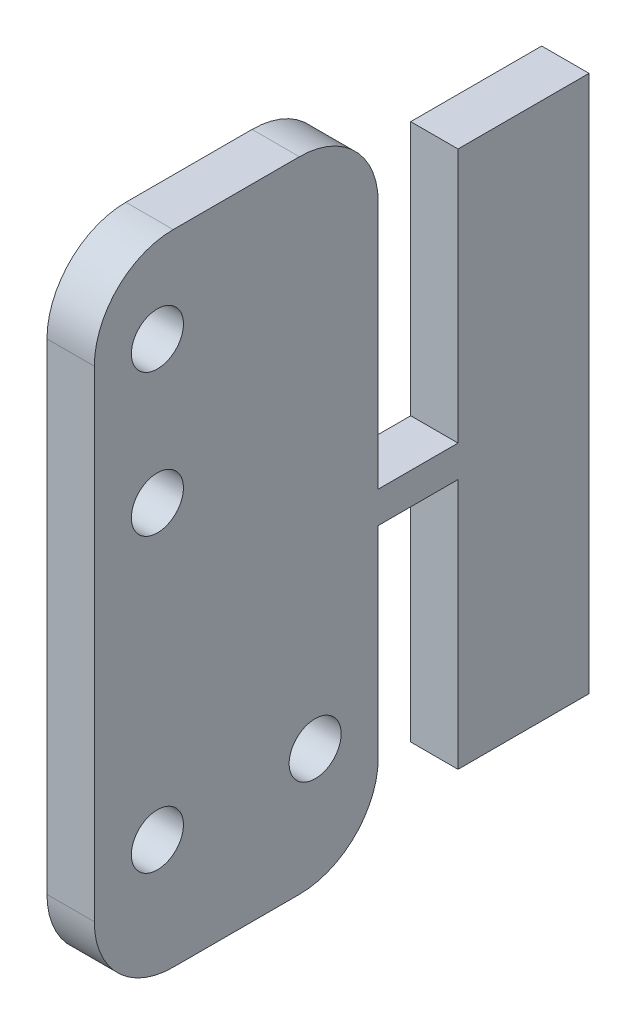
ISO-10303-21;
HEADER;
FILE_DESCRIPTION(('STEP AP214'),'2;1');
FILE_NAME('part.step','',(''),(''),'','','');
FILE_SCHEMA(('AUTOMOTIVE_DESIGN { 1 0 10303 214 1 1 1 1 }'));
ENDSEC;
DATA;
#1=APPLICATION_CONTEXT('core data for automotive mechanical design processes');
#2=APPLICATION_PROTOCOL_DEFINITION('international standard','automotive_design',2000,#1);
#3=PRODUCT_CONTEXT('',#1,'mechanical');
#4=PRODUCT('Part','Part','',(#3));
#5=PRODUCT_RELATED_PRODUCT_CATEGORY('part','',(#4));
#6=PRODUCT_DEFINITION_FORMATION('','',#4);
#7=PRODUCT_DEFINITION_CONTEXT('part definition',#1,'design');
#8=PRODUCT_DEFINITION('design','',#6,#7);
#9=PRODUCT_DEFINITION_SHAPE('','',#8);
#10=(LENGTH_UNIT() NAMED_UNIT(*) SI_UNIT(.MILLI.,.METRE.));
#11=(NAMED_UNIT(*) PLANE_ANGLE_UNIT() SI_UNIT($,.RADIAN.));
#12=(NAMED_UNIT(*) SI_UNIT($,.STERADIAN.) SOLID_ANGLE_UNIT());
#13=UNCERTAINTY_MEASURE_WITH_UNIT(LENGTH_MEASURE(1.E-05),#10,'distance_accuracy_value','');
#14=(GEOMETRIC_REPRESENTATION_CONTEXT(3) GLOBAL_UNCERTAINTY_ASSIGNED_CONTEXT((#13)) GLOBAL_UNIT_ASSIGNED_CONTEXT((#10,
#11,#12)) REPRESENTATION_CONTEXT('',''));
#15=CARTESIAN_POINT('',(0.,0.,0.));
#16=DIRECTION('',(0.,0.,1.));
#17=DIRECTION('',(1.,0.,0.));
#18=AXIS2_PLACEMENT_3D('',#15,#16,#17);
#19=CARTESIAN_POINT('',(5.,1.50221285621786,0.));
#20=DIRECTION('',(0.,0.,-1.));
#21=DIRECTION('',(0.,1.,0.));
#22=AXIS2_PLACEMENT_3D('',#19,#20,#21);
#23=PLANE('',#22);
#24=DIRECTION('',(1.,0.,0.));
#25=VECTOR('',#24,1.);
#26=CARTESIAN_POINT('',(0.,2.25110642810893,0.));
#27=LINE('',#26,#25);
#28=CARTESIAN_POINT('',(0.,2.25110642810893,0.));
#29=VERTEX_POINT('',#28);
#30=CARTESIAN_POINT('',(3.,2.25110642810893,0.));
#31=VERTEX_POINT('',#30);
#32=EDGE_CURVE('E218',#29,#31,#27,.T.);
#33=ORIENTED_EDGE('',*,*,#32,.T.);
#34=DIRECTION('',(0.,-1.,0.));
#35=VECTOR('',#34,1.);
#36=CARTESIAN_POINT('',(3.,-15.4977871437821,0.));
#37=LINE('',#36,#35);
#38=CARTESIAN_POINT('',(3.,-10.4977871437821,0.));
#39=VERTEX_POINT('',#38);
#40=EDGE_CURVE('E273',#39,#31,#37,.F.);
#41=ORIENTED_EDGE('',*,*,#40,.F.);
#42=DIRECTION('',(-1.,0.,0.));
#43=VECTOR('',#42,1.);
#44=CARTESIAN_POINT('',(5.,-10.4977871437821,0.));
#45=LINE('',#44,#43);
#46=CARTESIAN_POINT('',(0.,-10.4977871437821,0.));
#47=VERTEX_POINT('',#46);
#48=EDGE_CURVE('E12',#39,#47,#45,.T.);
#49=ORIENTED_EDGE('',*,*,#48,.T.);
#50=DIRECTION('',(0.,1.,0.));
#51=VECTOR('',#50,1.);
#52=CARTESIAN_POINT('',(0.,-15.4977871437821,0.));
#53=LINE('',#52,#51);
#54=EDGE_CURVE('E276',#47,#29,#53,.T.);
#55=ORIENTED_EDGE('',*,*,#54,.T.);
#56=EDGE_LOOP('',(#33,#41,#49,#55));
#57=FACE_BOUND('',#56,.T.);
#58=ADVANCED_FACE('F41',(#57),#23,.T.);
#59=DIRECTION('',(1.,0.,0.));
#60=VECTOR('',#59,1.);
#61=CARTESIAN_POINT('',(0.,4.25110642810894,0.));
#62=LINE('',#61,#60);
#63=CARTESIAN_POINT('',(0.,4.25110642810894,0.));
#64=VERTEX_POINT('',#63);
#65=CARTESIAN_POINT('',(3.,4.25110642810894,0.));
#66=VERTEX_POINT('',#65);
#67=EDGE_CURVE('E221',#64,#66,#62,.T.);
#68=ORIENTED_EDGE('',*,*,#67,.F.);
#69=CARTESIAN_POINT('',(0.,20.,0.));
#70=VERTEX_POINT('',#69);
#71=EDGE_CURVE('E280',#64,#70,#53,.T.);
#72=ORIENTED_EDGE('',*,*,#71,.T.);
#73=DIRECTION('',(1.,0.,0.));
#74=VECTOR('',#73,1.);
#75=CARTESIAN_POINT('',(3.,20.,0.));
#76=LINE('',#75,#74);
#77=CARTESIAN_POINT('',(3.,20.,0.));
#78=VERTEX_POINT('',#77);
#79=EDGE_CURVE('E224',#70,#78,#76,.T.);
#80=ORIENTED_EDGE('',*,*,#79,.T.);
#81=EDGE_CURVE('E279',#66,#78,#37,.F.);
#82=ORIENTED_EDGE('',*,*,#81,.F.);
#83=EDGE_LOOP('',(#68,#72,#80,#82));
#84=FACE_BOUND('',#83,.T.);
#85=ADVANCED_FACE('F333',(#84),#23,.T.);
#86=CARTESIAN_POINT('',(0.,0.,18.));
#87=DIRECTION('',(-1.,0.,0.));
#88=DIRECTION('',(0.,0.,1.));
#89=AXIS2_PLACEMENT_3D('',#86,#87,#88);
#90=PLANE('',#89);
#91=CARTESIAN_POINT('',(0.,-7.99778714378214,14.));
#92=DIRECTION('',(1.,0.,0.));
#93=DIRECTION('',(0.,0.,-1.));
#94=AXIS2_PLACEMENT_3D('',#91,#92,#93);
#95=CIRCLE('',#94,1.65);
#96=CARTESIAN_POINT('',(0.,-7.99778714378214,12.35));
#97=VERTEX_POINT('',#96);
#98=EDGE_CURVE('E227',#97,#97,#95,.T.);
#99=ORIENTED_EDGE('',*,*,#98,.T.);
#100=EDGE_LOOP('',(#99));
#101=FACE_BOUND('',#100,.T.);
#102=CARTESIAN_POINT('',(0.,-7.99778714378214,4.));
#103=DIRECTION('',(1.,0.,0.));
#104=DIRECTION('',(0.,0.,1.));
#105=AXIS2_PLACEMENT_3D('',#102,#103,#104);
#106=CIRCLE('',#105,1.65);
#107=CARTESIAN_POINT('',(0.,-7.99778714378214,5.65));
#108=VERTEX_POINT('',#107);
#109=EDGE_CURVE('E266',#108,#108,#106,.T.);
#110=ORIENTED_EDGE('',*,*,#109,.T.);
#111=EDGE_LOOP('',(#110));
#112=FACE_BOUND('',#111,.T.);
#113=DIRECTION('',(0.,0.,-1.));
#114=VECTOR('',#113,1.);
#115=CARTESIAN_POINT('',(0.,-15.4977871437821,18.));
#116=LINE('',#115,#114);
#117=CARTESIAN_POINT('',(0.,-15.4977871437821,13.));
#118=VERTEX_POINT('',#117);
#119=CARTESIAN_POINT('',(0.,-15.4977871437821,5.));
#120=VERTEX_POINT('',#119);
#121=EDGE_CURVE('E283',#118,#120,#116,.T.);
#122=ORIENTED_EDGE('',*,*,#121,.F.);
#123=CARTESIAN_POINT('',(0.,-10.4977871437821,13.));
#124=DIRECTION('',(-1.,0.,0.));
#125=DIRECTION('',(0.,0.,-1.));
#126=AXIS2_PLACEMENT_3D('',#123,#124,#125);
#127=CIRCLE('',#126,5.);
#128=CARTESIAN_POINT('',(0.,-10.4977871437821,18.));
#129=VERTEX_POINT('',#128);
#130=EDGE_CURVE('E297',#118,#129,#127,.T.);
#131=ORIENTED_EDGE('',*,*,#130,.T.);
#132=DIRECTION('',(0.,1.,0.));
#133=VECTOR('',#132,1.);
#134=CARTESIAN_POINT('',(0.,-15.4977871437821,18.));
#135=LINE('',#134,#133);
#136=CARTESIAN_POINT('',(0.,20.,18.));
#137=VERTEX_POINT('',#136);
#138=EDGE_CURVE('E270',#129,#137,#135,.T.);
#139=ORIENTED_EDGE('',*,*,#138,.T.);
#140=CARTESIAN_POINT('',(0.,20.,13.));
#141=DIRECTION('',(-1.,0.,0.));
#142=DIRECTION('',(0.,0.,1.));
#143=AXIS2_PLACEMENT_3D('',#140,#141,#142);
#144=CIRCLE('',#143,5.);
#145=CARTESIAN_POINT('',(0.,25.,13.));
#146=VERTEX_POINT('',#145);
#147=EDGE_CURVE('E242',#137,#146,#144,.T.);
#148=ORIENTED_EDGE('',*,*,#147,.T.);
#149=DIRECTION('',(0.,0.,-1.));
#150=VECTOR('',#149,1.);
#151=CARTESIAN_POINT('',(0.,25.,18.));
#152=LINE('',#151,#150);
#153=CARTESIAN_POINT('',(0.,25.,5.));
#154=VERTEX_POINT('',#153);
#155=EDGE_CURVE('E247',#146,#154,#152,.T.);
#156=ORIENTED_EDGE('',*,*,#155,.T.);
#157=CARTESIAN_POINT('',(0.,20.,5.));
#158=DIRECTION('',(-1.,0.,0.));
#159=DIRECTION('',(0.,0.,1.));
#160=AXIS2_PLACEMENT_3D('',#157,#158,#159);
#161=CIRCLE('',#160,5.);
#162=EDGE_CURVE('E244',#154,#70,#161,.T.);
#163=ORIENTED_EDGE('',*,*,#162,.T.);
#164=ORIENTED_EDGE('',*,*,#71,.F.);
#165=DIRECTION('',(0.,0.,1.));
#166=VECTOR('',#165,1.);
#167=CARTESIAN_POINT('',(0.,4.25110642810894,-5.05782413934766));
#168=LINE('',#167,#166);
#169=CARTESIAN_POINT('',(0.,4.25110642810894,-5.05782413934766));
#170=VERTEX_POINT('',#169);
#171=EDGE_CURVE('E177',#170,#64,#168,.T.);
#172=ORIENTED_EDGE('',*,*,#171,.F.);
#173=DIRECTION('',(0.,-1.,0.));
#174=VECTOR('',#173,1.);
#175=CARTESIAN_POINT('',(0.,20.3980287437023,-5.05782413934766));
#176=LINE('',#175,#174);
#177=CARTESIAN_POINT('',(0.,20.3980287437023,-5.05782413934766));
#178=VERTEX_POINT('',#177);
#179=EDGE_CURVE('E159',#178,#170,#176,.T.);
#180=ORIENTED_EDGE('',*,*,#179,.F.);
#181=DIRECTION('',(0.,0.,1.));
#182=VECTOR('',#181,1.);
#183=CARTESIAN_POINT('',(0.,20.3980287437023,-5.05782413934766));
#184=LINE('',#183,#182);
#185=CARTESIAN_POINT('',(0.,20.3980287437023,-13.3620721829113));
#186=VERTEX_POINT('',#185);
#187=EDGE_CURVE('E174',#186,#178,#184,.T.);
#188=ORIENTED_EDGE('',*,*,#187,.F.);
#189=DIRECTION('',(0.,1.,0.));
#190=VECTOR('',#189,1.);
#191=CARTESIAN_POINT('',(0.,20.3980287437023,-13.3620721829113));
#192=LINE('',#191,#190);
#193=CARTESIAN_POINT('',(0.,-13.6618229519394,-13.3620721829113));
#194=VERTEX_POINT('',#193);
#195=EDGE_CURVE('E166',#194,#186,#192,.T.);
#196=ORIENTED_EDGE('',*,*,#195,.F.);
#197=DIRECTION('',(0.,0.,-1.));
#198=VECTOR('',#197,1.);
#199=CARTESIAN_POINT('',(0.,-13.6618229519394,-5.05782413934766));
#200=LINE('',#199,#198);
#201=CARTESIAN_POINT('',(0.,-13.6618229519394,-5.05782413934766));
#202=VERTEX_POINT('',#201);
#203=EDGE_CURVE('E194',#202,#194,#200,.T.);
#204=ORIENTED_EDGE('',*,*,#203,.F.);
#205=DIRECTION('',(0.,-1.,0.));
#206=VECTOR('',#205,1.);
#207=CARTESIAN_POINT('',(0.,2.25110642810893,-5.05782413934766));
#208=LINE('',#207,#206);
#209=CARTESIAN_POINT('',(0.,2.25110642810893,-5.05782413934766));
#210=VERTEX_POINT('',#209);
#211=EDGE_CURVE('E191',#210,#202,#208,.T.);
#212=ORIENTED_EDGE('',*,*,#211,.F.);
#213=DIRECTION('',(0.,0.,-1.));
#214=VECTOR('',#213,1.);
#215=CARTESIAN_POINT('',(0.,2.25110642810893,0.));
#216=LINE('',#215,#214);
#217=EDGE_CURVE('E188',#29,#210,#216,.T.);
#218=ORIENTED_EDGE('',*,*,#217,.F.);
#219=ORIENTED_EDGE('',*,*,#54,.F.);
#220=CARTESIAN_POINT('',(0.,-10.4977871437821,5.));
#221=DIRECTION('',(-1.,0.,0.));
#222=DIRECTION('',(0.,0.,-1.));
#223=AXIS2_PLACEMENT_3D('',#220,#221,#222);
#224=CIRCLE('',#223,5.);
#225=EDGE_CURVE('E295',#47,#120,#224,.T.);
#226=ORIENTED_EDGE('',*,*,#225,.T.);
#227=EDGE_LOOP('',(#122,#131,#139,#148,#156,#163,#164,#172,#180,#188,#196,#204,#212,#218,#219,#226));
#228=FACE_BOUND('',#227,.T.);
#229=CARTESIAN_POINT('',(0.,10.5,14.));
#230=DIRECTION('',(1.,0.,0.));
#231=DIRECTION('',(0.,0.,1.));
#232=AXIS2_PLACEMENT_3D('',#229,#230,#231);
#233=CIRCLE('',#232,1.65);
#234=CARTESIAN_POINT('',(0.,10.5,15.65));
#235=VERTEX_POINT('',#234);
#236=EDGE_CURVE('E253',#235,#235,#233,.T.);
#237=ORIENTED_EDGE('',*,*,#236,.T.);
#238=EDGE_LOOP('',(#237));
#239=FACE_BOUND('',#238,.T.);
#240=CARTESIAN_POINT('',(0.,19.5,14.));
#241=DIRECTION('',(1.,0.,0.));
#242=DIRECTION('',(0.,0.,-1.));
#243=AXIS2_PLACEMENT_3D('',#240,#241,#242);
#244=CIRCLE('',#243,1.65);
#245=CARTESIAN_POINT('',(0.,19.5,12.35));
#246=VERTEX_POINT('',#245);
#247=EDGE_CURVE('E250',#246,#246,#244,.T.);
#248=ORIENTED_EDGE('',*,*,#247,.T.);
#249=EDGE_LOOP('',(#248));
#250=FACE_BOUND('',#249,.T.);
#251=ADVANCED_FACE('F43',(#101,#112,#228,#239,#250),#90,.T.);
#252=CARTESIAN_POINT('',(3.,-15.4977871437821,18.));
#253=DIRECTION('',(0.,-1.,0.));
#254=DIRECTION('',(0.,0.,-1.));
#255=AXIS2_PLACEMENT_3D('',#252,#253,#254);
#256=PLANE('',#255);
#257=DIRECTION('',(0.,0.,-1.));
#258=VECTOR('',#257,1.);
#259=CARTESIAN_POINT('',(3.,-15.4977871437821,18.));
#260=LINE('',#259,#258);
#261=CARTESIAN_POINT('',(3.,-15.4977871437821,13.));
#262=VERTEX_POINT('',#261);
#263=CARTESIAN_POINT('',(3.,-15.4977871437821,5.));
#264=VERTEX_POINT('',#263);
#265=EDGE_CURVE('E275',#262,#264,#260,.T.);
#266=ORIENTED_EDGE('',*,*,#265,.F.);
#267=DIRECTION('',(-1.,0.,0.));
#268=VECTOR('',#267,1.);
#269=CARTESIAN_POINT('',(3.,-15.4977871437821,13.));
#270=LINE('',#269,#268);
#271=EDGE_CURVE('E292',#262,#118,#270,.T.);
#272=ORIENTED_EDGE('',*,*,#271,.T.);
#273=ORIENTED_EDGE('',*,*,#121,.T.);
#274=DIRECTION('',(-1.,0.,0.));
#275=VECTOR('',#274,1.);
#276=CARTESIAN_POINT('',(3.,-15.4977871437821,5.));
#277=LINE('',#276,#275);
#278=EDGE_CURVE('E286',#120,#264,#277,.F.);
#279=ORIENTED_EDGE('',*,*,#278,.T.);
#280=EDGE_LOOP('',(#266,#272,#273,#279));
#281=FACE_BOUND('',#280,.T.);
#282=ADVANCED_FACE('F310',(#281),#256,.T.);
#283=CARTESIAN_POINT('',(3.,-15.4977871437821,18.));
#284=DIRECTION('',(-1.,0.,0.));
#285=DIRECTION('',(0.,0.,-1.));
#286=AXIS2_PLACEMENT_3D('',#283,#284,#285);
#287=PLANE('',#286);
#288=CARTESIAN_POINT('',(3.,-7.99778714378214,14.));
#289=DIRECTION('',(-1.,0.,0.));
#290=DIRECTION('',(0.,0.,-1.));
#291=AXIS2_PLACEMENT_3D('',#288,#289,#290);
#292=CIRCLE('',#291,1.65);
#293=CARTESIAN_POINT('',(3.,-7.99778714378214,12.35));
#294=VERTEX_POINT('',#293);
#295=EDGE_CURVE('E265',#294,#294,#292,.T.);
#296=ORIENTED_EDGE('',*,*,#295,.T.);
#297=EDGE_LOOP('',(#296));
#298=FACE_BOUND('',#297,.T.);
#299=CARTESIAN_POINT('',(3.,-7.99778714378214,4.));
#300=DIRECTION('',(-1.,0.,0.));
#301=DIRECTION('',(0.,0.,-1.));
#302=AXIS2_PLACEMENT_3D('',#299,#300,#301);
#303=CIRCLE('',#302,1.65);
#304=CARTESIAN_POINT('',(3.,-7.99778714378214,2.35));
#305=VERTEX_POINT('',#304);
#306=EDGE_CURVE('E269',#305,#305,#303,.T.);
#307=ORIENTED_EDGE('',*,*,#306,.T.);
#308=EDGE_LOOP('',(#307));
#309=FACE_BOUND('',#308,.T.);
#310=DIRECTION('',(0.,-1.,0.));
#311=VECTOR('',#310,1.);
#312=CARTESIAN_POINT('',(3.,-15.4977871437821,18.));
#313=LINE('',#312,#311);
#314=CARTESIAN_POINT('',(3.,-10.4977871437821,18.));
#315=VERTEX_POINT('',#314);
#316=CARTESIAN_POINT('',(3.,20.,18.));
#317=VERTEX_POINT('',#316);
#318=EDGE_CURVE('E272',#315,#317,#313,.F.);
#319=ORIENTED_EDGE('',*,*,#318,.F.);
#320=CARTESIAN_POINT('',(3.,-10.4977871437821,13.));
#321=DIRECTION('',(-1.,0.,0.));
#322=DIRECTION('',(0.,0.,-1.));
#323=AXIS2_PLACEMENT_3D('',#320,#321,#322);
#324=CIRCLE('',#323,5.);
#325=EDGE_CURVE('E49',#315,#262,#324,.F.);
#326=ORIENTED_EDGE('',*,*,#325,.T.);
#327=ORIENTED_EDGE('',*,*,#265,.T.);
#328=CARTESIAN_POINT('',(3.,-10.4977871437821,5.));
#329=DIRECTION('',(-1.,0.,0.));
#330=DIRECTION('',(0.,0.,-1.));
#331=AXIS2_PLACEMENT_3D('',#328,#329,#330);
#332=CIRCLE('',#331,5.);
#333=EDGE_CURVE('E63',#264,#39,#332,.F.);
#334=ORIENTED_EDGE('',*,*,#333,.T.);
#335=ORIENTED_EDGE('',*,*,#40,.T.);
#336=DIRECTION('',(0.,0.,-1.));
#337=VECTOR('',#336,1.);
#338=CARTESIAN_POINT('',(3.,2.25110642810893,0.));
#339=LINE('',#338,#337);
#340=CARTESIAN_POINT('',(3.,2.25110642810893,-5.05782413934766));
#341=VERTEX_POINT('',#340);
#342=EDGE_CURVE('E202',#31,#341,#339,.T.);
#343=ORIENTED_EDGE('',*,*,#342,.T.);
#344=DIRECTION('',(0.,-1.,0.));
#345=VECTOR('',#344,1.);
#346=CARTESIAN_POINT('',(3.,2.25110642810893,-5.05782413934766));
#347=LINE('',#346,#345);
#348=CARTESIAN_POINT('',(3.,-13.6618229519394,-5.05782413934766));
#349=VERTEX_POINT('',#348);
#350=EDGE_CURVE('E205',#341,#349,#347,.T.);
#351=ORIENTED_EDGE('',*,*,#350,.T.);
#352=DIRECTION('',(0.,0.,-1.));
#353=VECTOR('',#352,1.);
#354=CARTESIAN_POINT('',(3.,-13.6618229519394,-5.05782413934766));
#355=LINE('',#354,#353);
#356=CARTESIAN_POINT('',(3.,-13.6618229519394,-13.3620721829113));
#357=VERTEX_POINT('',#356);
#358=EDGE_CURVE('E184',#349,#357,#355,.T.);
#359=ORIENTED_EDGE('',*,*,#358,.T.);
#360=DIRECTION('',(0.,1.,0.));
#361=VECTOR('',#360,1.);
#362=CARTESIAN_POINT('',(3.,20.3980287437023,-13.3620721829113));
#363=LINE('',#362,#361);
#364=CARTESIAN_POINT('',(3.,20.3980287437023,-13.3620721829113));
#365=VERTEX_POINT('',#364);
#366=EDGE_CURVE('E181',#357,#365,#363,.T.);
#367=ORIENTED_EDGE('',*,*,#366,.T.);
#368=DIRECTION('',(0.,0.,1.));
#369=VECTOR('',#368,1.);
#370=CARTESIAN_POINT('',(3.,20.3980287437023,-5.05782413934766));
#371=LINE('',#370,#369);
#372=CARTESIAN_POINT('',(3.,20.3980287437023,-5.05782413934766));
#373=VERTEX_POINT('',#372);
#374=EDGE_CURVE('E198',#365,#373,#371,.T.);
#375=ORIENTED_EDGE('',*,*,#374,.T.);
#376=DIRECTION('',(0.,-1.,0.));
#377=VECTOR('',#376,1.);
#378=CARTESIAN_POINT('',(3.,20.3980287437023,-5.05782413934766));
#379=LINE('',#378,#377);
#380=CARTESIAN_POINT('',(3.,4.25110642810894,-5.05782413934766));
#381=VERTEX_POINT('',#380);
#382=EDGE_CURVE('E160',#373,#381,#379,.T.);
#383=ORIENTED_EDGE('',*,*,#382,.T.);
#384=DIRECTION('',(0.,0.,1.));
#385=VECTOR('',#384,1.);
#386=CARTESIAN_POINT('',(3.,4.25110642810894,-5.05782413934766));
#387=LINE('',#386,#385);
#388=EDGE_CURVE('E56',#381,#66,#387,.T.);
#389=ORIENTED_EDGE('',*,*,#388,.T.);
#390=ORIENTED_EDGE('',*,*,#81,.T.);
#391=CARTESIAN_POINT('',(3.,20.,5.));
#392=DIRECTION('',(-1.,0.,0.));
#393=DIRECTION('',(0.,0.,1.));
#394=AXIS2_PLACEMENT_3D('',#391,#392,#393);
#395=CIRCLE('',#394,5.);
#396=CARTESIAN_POINT('',(3.,25.,5.));
#397=VERTEX_POINT('',#396);
#398=EDGE_CURVE('E231',#78,#397,#395,.F.);
#399=ORIENTED_EDGE('',*,*,#398,.T.);
#400=DIRECTION('',(0.,0.,-1.));
#401=VECTOR('',#400,1.);
#402=CARTESIAN_POINT('',(3.,25.,18.));
#403=LINE('',#402,#401);
#404=CARTESIAN_POINT('',(3.,25.,13.));
#405=VERTEX_POINT('',#404);
#406=EDGE_CURVE('E211',#405,#397,#403,.T.);
#407=ORIENTED_EDGE('',*,*,#406,.F.);
#408=CARTESIAN_POINT('',(3.,20.,13.));
#409=DIRECTION('',(-1.,0.,0.));
#410=DIRECTION('',(0.,0.,1.));
#411=AXIS2_PLACEMENT_3D('',#408,#409,#410);
#412=CIRCLE('',#411,5.);
#413=EDGE_CURVE('E228',#405,#317,#412,.F.);
#414=ORIENTED_EDGE('',*,*,#413,.T.);
#415=EDGE_LOOP('',(#319,#326,#327,#334,#335,#343,#351,#359,#367,#375,#383,#389,#390,#399,#407,#414));
#416=FACE_BOUND('',#415,.T.);
#417=CARTESIAN_POINT('',(3.,10.5,14.));
#418=DIRECTION('',(-1.,0.,0.));
#419=DIRECTION('',(0.,0.,1.));
#420=AXIS2_PLACEMENT_3D('',#417,#418,#419);
#421=CIRCLE('',#420,1.65);
#422=CARTESIAN_POINT('',(3.,10.5,15.65));
#423=VERTEX_POINT('',#422);
#424=EDGE_CURVE('E236',#423,#423,#421,.T.);
#425=ORIENTED_EDGE('',*,*,#424,.T.);
#426=EDGE_LOOP('',(#425));
#427=FACE_BOUND('',#426,.T.);
#428=CARTESIAN_POINT('',(3.,19.5,14.));
#429=DIRECTION('',(-1.,0.,0.));
#430=DIRECTION('',(0.,0.,1.));
#431=AXIS2_PLACEMENT_3D('',#428,#429,#430);
#432=CIRCLE('',#431,1.65);
#433=CARTESIAN_POINT('',(3.,19.5,15.65));
#434=VERTEX_POINT('',#433);
#435=EDGE_CURVE('E233',#434,#434,#432,.T.);
#436=ORIENTED_EDGE('',*,*,#435,.T.);
#437=EDGE_LOOP('',(#436));
#438=FACE_BOUND('',#437,.T.);
#439=ADVANCED_FACE('F304',(#298,#309,#416,#427,#438),#287,.F.);
#440=CARTESIAN_POINT('',(5.,-0.497787143782138,18.));
#441=DIRECTION('',(0.,0.,1.));
#442=DIRECTION('',(0.,-1.,0.));
#443=AXIS2_PLACEMENT_3D('',#440,#441,#442);
#444=PLANE('',#443);
#445=ORIENTED_EDGE('',*,*,#138,.F.);
#446=DIRECTION('',(-1.,0.,0.));
#447=VECTOR('',#446,1.);
#448=CARTESIAN_POINT('',(5.,-10.4977871437821,18.));
#449=LINE('',#448,#447);
#450=EDGE_CURVE('E299',#129,#315,#449,.F.);
#451=ORIENTED_EDGE('',*,*,#450,.T.);
#452=ORIENTED_EDGE('',*,*,#318,.T.);
#453=DIRECTION('',(1.,0.,0.));
#454=VECTOR('',#453,1.);
#455=CARTESIAN_POINT('',(5.,20.,18.));
#456=LINE('',#455,#454);
#457=EDGE_CURVE('E239',#317,#137,#456,.F.);
#458=ORIENTED_EDGE('',*,*,#457,.T.);
#459=EDGE_LOOP('',(#445,#451,#452,#458));
#460=FACE_BOUND('',#459,.T.);
#461=ADVANCED_FACE('F315',(#460),#444,.T.);
#462=CARTESIAN_POINT('',(0.,-7.99778714378214,4.));
#463=DIRECTION('',(1.,0.,0.));
#464=DIRECTION('',(0.,0.,1.));
#465=AXIS2_PLACEMENT_3D('',#462,#463,#464);
#466=CYLINDRICAL_SURFACE('',#465,1.65);
#467=ORIENTED_EDGE('',*,*,#109,.F.);
#468=EDGE_LOOP('',(#467));
#469=FACE_BOUND('',#468,.T.);
#470=ORIENTED_EDGE('',*,*,#306,.F.);
#471=EDGE_LOOP('',(#470));
#472=FACE_BOUND('',#471,.T.);
#473=ADVANCED_FACE('F376',(#469,#472),#466,.F.);
#474=CARTESIAN_POINT('',(0.,-7.99778714378214,14.));
#475=DIRECTION('',(1.,0.,0.));
#476=DIRECTION('',(0.,0.,1.));
#477=AXIS2_PLACEMENT_3D('',#474,#475,#476);
#478=CYLINDRICAL_SURFACE('',#477,1.65);
#479=ORIENTED_EDGE('',*,*,#98,.F.);
#480=EDGE_LOOP('',(#479));
#481=FACE_BOUND('',#480,.T.);
#482=ORIENTED_EDGE('',*,*,#295,.F.);
#483=EDGE_LOOP('',(#482));
#484=FACE_BOUND('',#483,.T.);
#485=ADVANCED_FACE('F361',(#481,#484),#478,.F.);
#486=CARTESIAN_POINT('',(3.,-10.4977871437821,13.));
#487=DIRECTION('',(-1.,0.,0.));
#488=DIRECTION('',(0.,0.,-1.));
#489=AXIS2_PLACEMENT_3D('',#486,#487,#488);
#490=CYLINDRICAL_SURFACE('',#489,5.);
#491=ORIENTED_EDGE('',*,*,#325,.F.);
#492=ORIENTED_EDGE('',*,*,#450,.F.);
#493=ORIENTED_EDGE('',*,*,#130,.F.);
#494=ORIENTED_EDGE('',*,*,#271,.F.);
#495=EDGE_LOOP('',(#491,#492,#493,#494));
#496=FACE_BOUND('',#495,.T.);
#497=ADVANCED_FACE('F312',(#496),#490,.T.);
#498=CARTESIAN_POINT('',(5.,-10.4977871437821,5.));
#499=DIRECTION('',(-1.,0.,0.));
#500=DIRECTION('',(0.,0.,-1.));
#501=AXIS2_PLACEMENT_3D('',#498,#499,#500);
#502=CYLINDRICAL_SURFACE('',#501,5.);
#503=ORIENTED_EDGE('',*,*,#333,.F.);
#504=ORIENTED_EDGE('',*,*,#278,.F.);
#505=ORIENTED_EDGE('',*,*,#225,.F.);
#506=ORIENTED_EDGE('',*,*,#48,.F.);
#507=EDGE_LOOP('',(#503,#504,#505,#506));
#508=FACE_BOUND('',#507,.T.);
#509=ADVANCED_FACE('F354',(#508),#502,.T.);
#510=CARTESIAN_POINT('',(0.,20.,13.));
#511=DIRECTION('',(1.,0.,0.));
#512=DIRECTION('',(0.,0.,-1.));
#513=AXIS2_PLACEMENT_3D('',#510,#511,#512);
#514=CYLINDRICAL_SURFACE('',#513,5.);
#515=ORIENTED_EDGE('',*,*,#147,.F.);
#516=ORIENTED_EDGE('',*,*,#457,.F.);
#517=ORIENTED_EDGE('',*,*,#413,.F.);
#518=DIRECTION('',(1.,0.,0.));
#519=VECTOR('',#518,1.);
#520=CARTESIAN_POINT('',(0.,25.,13.));
#521=LINE('',#520,#519);
#522=EDGE_CURVE('E256',#146,#405,#521,.T.);
#523=ORIENTED_EDGE('',*,*,#522,.F.);
#524=EDGE_LOOP('',(#515,#516,#517,#523));
#525=FACE_BOUND('',#524,.T.);
#526=ADVANCED_FACE('F320',(#525),#514,.T.);
#527=CARTESIAN_POINT('',(5.,20.,5.));
#528=DIRECTION('',(-1.,0.,0.));
#529=DIRECTION('',(0.,0.,1.));
#530=AXIS2_PLACEMENT_3D('',#527,#528,#529);
#531=CYLINDRICAL_SURFACE('',#530,5.);
#532=ORIENTED_EDGE('',*,*,#162,.F.);
#533=DIRECTION('',(1.,0.,0.));
#534=VECTOR('',#533,1.);
#535=CARTESIAN_POINT('',(0.,25.,5.));
#536=LINE('',#535,#534);
#537=EDGE_CURVE('E259',#397,#154,#536,.F.);
#538=ORIENTED_EDGE('',*,*,#537,.F.);
#539=ORIENTED_EDGE('',*,*,#398,.F.);
#540=ORIENTED_EDGE('',*,*,#79,.F.);
#541=EDGE_LOOP('',(#532,#538,#539,#540));
#542=FACE_BOUND('',#541,.T.);
#543=ADVANCED_FACE('F329',(#542),#531,.T.);
#544=CARTESIAN_POINT('',(0.,25.,18.));
#545=DIRECTION('',(0.,1.,0.));
#546=DIRECTION('',(0.,0.,1.));
#547=AXIS2_PLACEMENT_3D('',#544,#545,#546);
#548=PLANE('',#547);
#549=ORIENTED_EDGE('',*,*,#406,.T.);
#550=ORIENTED_EDGE('',*,*,#537,.T.);
#551=ORIENTED_EDGE('',*,*,#155,.F.);
#552=ORIENTED_EDGE('',*,*,#522,.T.);
#553=EDGE_LOOP('',(#549,#550,#551,#552));
#554=FACE_BOUND('',#553,.T.);
#555=ADVANCED_FACE('F324',(#554),#548,.T.);
#556=CARTESIAN_POINT('',(0.,19.5,14.));
#557=DIRECTION('',(1.,0.,0.));
#558=DIRECTION('',(0.,0.,-1.));
#559=AXIS2_PLACEMENT_3D('',#556,#557,#558);
#560=CYLINDRICAL_SURFACE('',#559,1.65);
#561=ORIENTED_EDGE('',*,*,#247,.F.);
#562=EDGE_LOOP('',(#561));
#563=FACE_BOUND('',#562,.T.);
#564=ORIENTED_EDGE('',*,*,#435,.F.);
#565=EDGE_LOOP('',(#564));
#566=FACE_BOUND('',#565,.T.);
#567=ADVANCED_FACE('F386',(#563,#566),#560,.F.);
#568=CARTESIAN_POINT('',(0.,10.5,14.));
#569=DIRECTION('',(1.,0.,0.));
#570=DIRECTION('',(0.,0.,-1.));
#571=AXIS2_PLACEMENT_3D('',#568,#569,#570);
#572=CYLINDRICAL_SURFACE('',#571,1.65);
#573=ORIENTED_EDGE('',*,*,#236,.F.);
#574=EDGE_LOOP('',(#573));
#575=FACE_BOUND('',#574,.T.);
#576=ORIENTED_EDGE('',*,*,#424,.F.);
#577=EDGE_LOOP('',(#576));
#578=FACE_BOUND('',#577,.T.);
#579=ADVANCED_FACE('F383',(#575,#578),#572,.F.);
#580=CARTESIAN_POINT('',(0.,20.3980287437023,-5.05782413934766));
#581=DIRECTION('',(0.,1.,0.));
#582=DIRECTION('',(-1.,0.,0.));
#583=AXIS2_PLACEMENT_3D('',#580,#581,#582);
#584=PLANE('',#583);
#585=ORIENTED_EDGE('',*,*,#374,.F.);
#586=DIRECTION('',(1.,0.,0.));
#587=VECTOR('',#586,1.);
#588=CARTESIAN_POINT('',(0.,20.3980287437023,-13.3620721829113));
#589=LINE('',#588,#587);
#590=EDGE_CURVE('E180',#186,#365,#589,.T.);
#591=ORIENTED_EDGE('',*,*,#590,.F.);
#592=ORIENTED_EDGE('',*,*,#187,.T.);
#593=DIRECTION('',(1.,0.,0.));
#594=VECTOR('',#593,1.);
#595=CARTESIAN_POINT('',(0.,20.3980287437023,-5.05782413934766));
#596=LINE('',#595,#594);
#597=EDGE_CURVE('E156',#178,#373,#596,.T.);
#598=ORIENTED_EDGE('',*,*,#597,.T.);
#599=EDGE_LOOP('',(#585,#591,#592,#598));
#600=FACE_BOUND('',#599,.T.);
#601=ADVANCED_FACE('F179',(#600),#584,.T.);
#602=CARTESIAN_POINT('',(0.,20.3980287437023,-13.3620721829113));
#603=DIRECTION('',(0.,0.,-1.));
#604=DIRECTION('',(0.,1.,0.));
#605=AXIS2_PLACEMENT_3D('',#602,#603,#604);
#606=PLANE('',#605);
#607=ORIENTED_EDGE('',*,*,#366,.F.);
#608=DIRECTION('',(1.,0.,0.));
#609=VECTOR('',#608,1.);
#610=CARTESIAN_POINT('',(0.,-13.6618229519394,-13.3620721829113));
#611=LINE('',#610,#609);
#612=EDGE_CURVE('E212',#194,#357,#611,.T.);
#613=ORIENTED_EDGE('',*,*,#612,.F.);
#614=ORIENTED_EDGE('',*,*,#195,.T.);
#615=ORIENTED_EDGE('',*,*,#590,.T.);
#616=EDGE_LOOP('',(#607,#613,#614,#615));
#617=FACE_BOUND('',#616,.T.);
#618=ADVANCED_FACE('F340',(#617),#606,.T.);
#619=CARTESIAN_POINT('',(0.,-13.6618229519394,-5.05782413934766));
#620=DIRECTION('',(0.,-1.,0.));
#621=DIRECTION('',(1.,0.,0.));
#622=AXIS2_PLACEMENT_3D('',#619,#620,#621);
#623=PLANE('',#622);
#624=ORIENTED_EDGE('',*,*,#358,.F.);
#625=DIRECTION('',(1.,0.,0.));
#626=VECTOR('',#625,1.);
#627=CARTESIAN_POINT('',(0.,-13.6618229519394,-5.05782413934766));
#628=LINE('',#627,#626);
#629=EDGE_CURVE('E214',#202,#349,#628,.T.);
#630=ORIENTED_EDGE('',*,*,#629,.F.);
#631=ORIENTED_EDGE('',*,*,#203,.T.);
#632=ORIENTED_EDGE('',*,*,#612,.T.);
#633=EDGE_LOOP('',(#624,#630,#631,#632));
#634=FACE_BOUND('',#633,.T.);
#635=ADVANCED_FACE('F405',(#634),#623,.T.);
#636=CARTESIAN_POINT('',(0.,2.25110642810893,-5.05782413934766));
#637=DIRECTION('',(0.,0.,1.));
#638=DIRECTION('',(1.,0.,0.));
#639=AXIS2_PLACEMENT_3D('',#636,#637,#638);
#640=PLANE('',#639);
#641=ORIENTED_EDGE('',*,*,#350,.F.);
#642=DIRECTION('',(1.,0.,0.));
#643=VECTOR('',#642,1.);
#644=CARTESIAN_POINT('',(0.,2.25110642810893,-5.05782413934766));
#645=LINE('',#644,#643);
#646=EDGE_CURVE('E216',#210,#341,#645,.T.);
#647=ORIENTED_EDGE('',*,*,#646,.F.);
#648=ORIENTED_EDGE('',*,*,#211,.T.);
#649=ORIENTED_EDGE('',*,*,#629,.T.);
#650=EDGE_LOOP('',(#641,#647,#648,#649));
#651=FACE_BOUND('',#650,.T.);
#652=ADVANCED_FACE('F347',(#651),#640,.T.);
#653=CARTESIAN_POINT('',(0.,2.25110642810893,0.));
#654=DIRECTION('',(0.,-1.,0.));
#655=DIRECTION('',(1.,0.,0.));
#656=AXIS2_PLACEMENT_3D('',#653,#654,#655);
#657=PLANE('',#656);
#658=ORIENTED_EDGE('',*,*,#342,.F.);
#659=ORIENTED_EDGE('',*,*,#32,.F.);
#660=ORIENTED_EDGE('',*,*,#217,.T.);
#661=ORIENTED_EDGE('',*,*,#646,.T.);
#662=EDGE_LOOP('',(#658,#659,#660,#661));
#663=FACE_BOUND('',#662,.T.);
#664=ADVANCED_FACE('F349',(#663),#657,.T.);
#665=CARTESIAN_POINT('',(0.,4.25110642810894,-5.05782413934766));
#666=DIRECTION('',(0.,1.,0.));
#667=DIRECTION('',(-1.,0.,0.));
#668=AXIS2_PLACEMENT_3D('',#665,#666,#667);
#669=PLANE('',#668);
#670=ORIENTED_EDGE('',*,*,#388,.F.);
#671=DIRECTION('',(1.,0.,0.));
#672=VECTOR('',#671,1.);
#673=CARTESIAN_POINT('',(0.,4.25110642810894,-5.05782413934766));
#674=LINE('',#673,#672);
#675=EDGE_CURVE('E165',#170,#381,#674,.T.);
#676=ORIENTED_EDGE('',*,*,#675,.F.);
#677=ORIENTED_EDGE('',*,*,#171,.T.);
#678=ORIENTED_EDGE('',*,*,#67,.T.);
#679=EDGE_LOOP('',(#670,#676,#677,#678));
#680=FACE_BOUND('',#679,.T.);
#681=ADVANCED_FACE('F336',(#680),#669,.T.);
#682=CARTESIAN_POINT('',(0.,20.3980287437023,-5.05782413934766));
#683=DIRECTION('',(0.,0.,1.));
#684=DIRECTION('',(1.,0.,0.));
#685=AXIS2_PLACEMENT_3D('',#682,#683,#684);
#686=PLANE('',#685);
#687=ORIENTED_EDGE('',*,*,#382,.F.);
#688=ORIENTED_EDGE('',*,*,#597,.F.);
#689=ORIENTED_EDGE('',*,*,#179,.T.);
#690=ORIENTED_EDGE('',*,*,#675,.T.);
#691=EDGE_LOOP('',(#687,#688,#689,#690));
#692=FACE_BOUND('',#691,.T.);
#693=ADVANCED_FACE('F158',(#692),#686,.T.);
#694=CLOSED_SHELL('',(#58,#85,#251,#282,#439,#461,#473,#485,#497,#509,#526,#543,#555,#567,#579,
#601,#618,#635,#652,#664,#681,#693));
#695=MANIFOLD_SOLID_BREP('B2',#694);
#696=ADVANCED_BREP_SHAPE_REPRESENTATION('',(#18,#695),#14);
#697=SHAPE_DEFINITION_REPRESENTATION(#9,#696);
ENDSEC;
END-ISO-10303-21;
